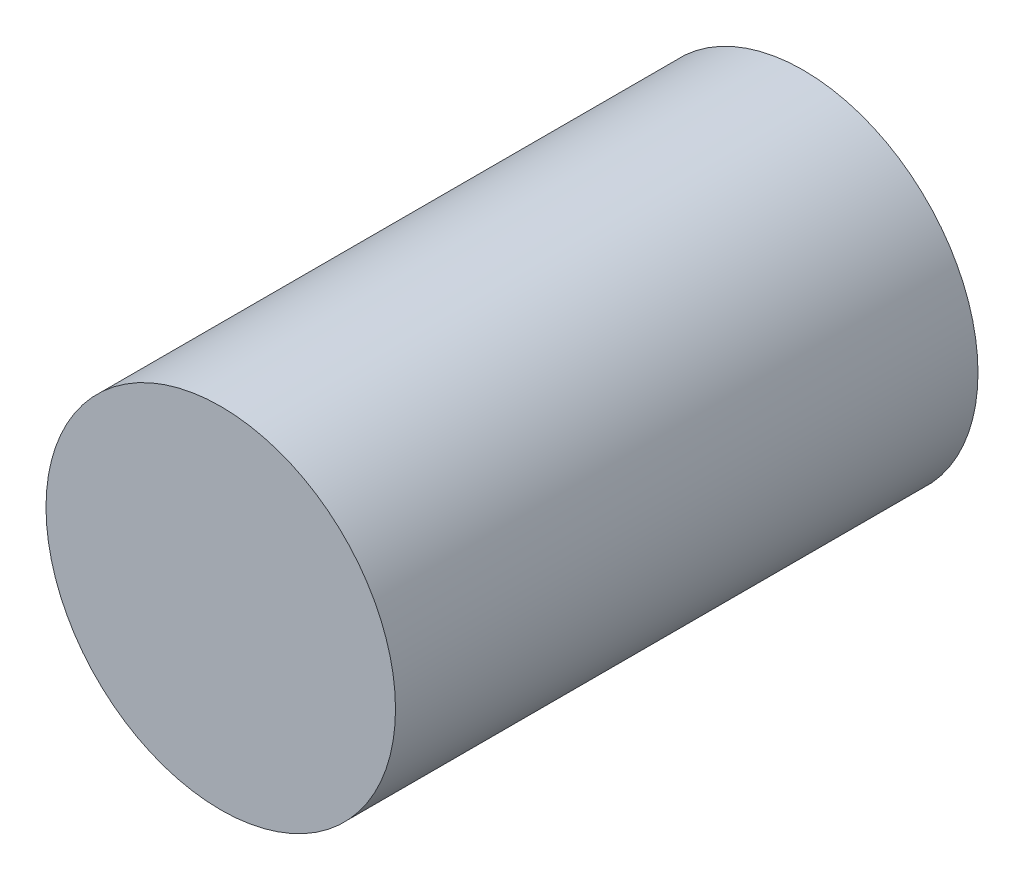
ISO-10303-21;
HEADER;
FILE_DESCRIPTION(('STEP AP214'),'2;1');
FILE_NAME('part.step','',(''),(''),'','','');
FILE_SCHEMA(('AUTOMOTIVE_DESIGN { 1 0 10303 214 1 1 1 1 }'));
ENDSEC;
DATA;
#1=APPLICATION_CONTEXT('core data for automotive mechanical design processes');
#2=APPLICATION_PROTOCOL_DEFINITION('international standard','automotive_design',2000,#1);
#3=PRODUCT_CONTEXT('',#1,'mechanical');
#4=PRODUCT('Part','Part','',(#3));
#5=PRODUCT_RELATED_PRODUCT_CATEGORY('part','',(#4));
#6=PRODUCT_DEFINITION_FORMATION('','',#4);
#7=PRODUCT_DEFINITION_CONTEXT('part definition',#1,'design');
#8=PRODUCT_DEFINITION('design','',#6,#7);
#9=PRODUCT_DEFINITION_SHAPE('','',#8);
#10=(LENGTH_UNIT() NAMED_UNIT(*) SI_UNIT(.MILLI.,.METRE.));
#11=(NAMED_UNIT(*) PLANE_ANGLE_UNIT() SI_UNIT($,.RADIAN.));
#12=(NAMED_UNIT(*) SI_UNIT($,.STERADIAN.) SOLID_ANGLE_UNIT());
#13=UNCERTAINTY_MEASURE_WITH_UNIT(LENGTH_MEASURE(1.E-05),#10,'distance_accuracy_value','');
#14=(GEOMETRIC_REPRESENTATION_CONTEXT(3) GLOBAL_UNCERTAINTY_ASSIGNED_CONTEXT((#13)) GLOBAL_UNIT_ASSIGNED_CONTEXT((#10,
#11,#12)) REPRESENTATION_CONTEXT('',''));
#15=CARTESIAN_POINT('',(0.,0.,0.));
#16=DIRECTION('',(0.,0.,1.));
#17=DIRECTION('',(1.,0.,0.));
#18=AXIS2_PLACEMENT_3D('',#15,#16,#17);
#19=CARTESIAN_POINT('',(0.,0.,10.));
#20=DIRECTION('',(0.,0.,-1.));
#21=DIRECTION('',(-1.,0.,0.));
#22=AXIS2_PLACEMENT_3D('',#19,#20,#21);
#23=CYLINDRICAL_SURFACE('',#22,6.);
#24=CARTESIAN_POINT('',(0.,0.,10.));
#25=DIRECTION('',(0.,0.,1.));
#26=DIRECTION('',(1.,0.,0.));
#27=AXIS2_PLACEMENT_3D('',#24,#25,#26);
#28=CIRCLE('',#27,6.);
#29=CARTESIAN_POINT('',(6.,0.,10.));
#30=VERTEX_POINT('',#29);
#31=EDGE_CURVE('E10',#30,#30,#28,.T.);
#32=ORIENTED_EDGE('',*,*,#31,.F.);
#33=EDGE_LOOP('',(#32));
#34=FACE_BOUND('',#33,.T.);
#35=CARTESIAN_POINT('',(0.,0.,-10.));
#36=DIRECTION('',(0.,0.,1.));
#37=DIRECTION('',(1.,0.,0.));
#38=AXIS2_PLACEMENT_3D('',#35,#36,#37);
#39=CIRCLE('',#38,6.);
#40=CARTESIAN_POINT('',(6.,0.,-10.));
#41=VERTEX_POINT('',#40);
#42=EDGE_CURVE('E42',#41,#41,#39,.T.);
#43=ORIENTED_EDGE('',*,*,#42,.T.);
#44=EDGE_LOOP('',(#43));
#45=FACE_BOUND('',#44,.T.);
#46=ADVANCED_FACE('F39',(#34,#45),#23,.T.);
#47=CARTESIAN_POINT('',(0.,0.,10.));
#48=DIRECTION('',(0.,0.,1.));
#49=DIRECTION('',(1.,0.,0.));
#50=AXIS2_PLACEMENT_3D('',#47,#48,#49);
#51=PLANE('',#50);
#52=ORIENTED_EDGE('',*,*,#31,.T.);
#53=EDGE_LOOP('',(#52));
#54=FACE_BOUND('',#53,.T.);
#55=ADVANCED_FACE('F54',(#54),#51,.T.);
#56=CARTESIAN_POINT('',(0.,0.,-10.));
#57=DIRECTION('',(0.,0.,1.));
#58=DIRECTION('',(1.,0.,0.));
#59=AXIS2_PLACEMENT_3D('',#56,#57,#58);
#60=PLANE('',#59);
#61=ORIENTED_EDGE('',*,*,#42,.F.);
#62=EDGE_LOOP('',(#61));
#63=FACE_BOUND('',#62,.T.);
#64=ADVANCED_FACE('F52',(#63),#60,.F.);
#65=CLOSED_SHELL('',(#46,#55,#64));
#66=MANIFOLD_SOLID_BREP('B2',#65);
#67=ADVANCED_BREP_SHAPE_REPRESENTATION('',(#18,#66),#14);
#68=SHAPE_DEFINITION_REPRESENTATION(#9,#67);
ENDSEC;
END-ISO-10303-21;
